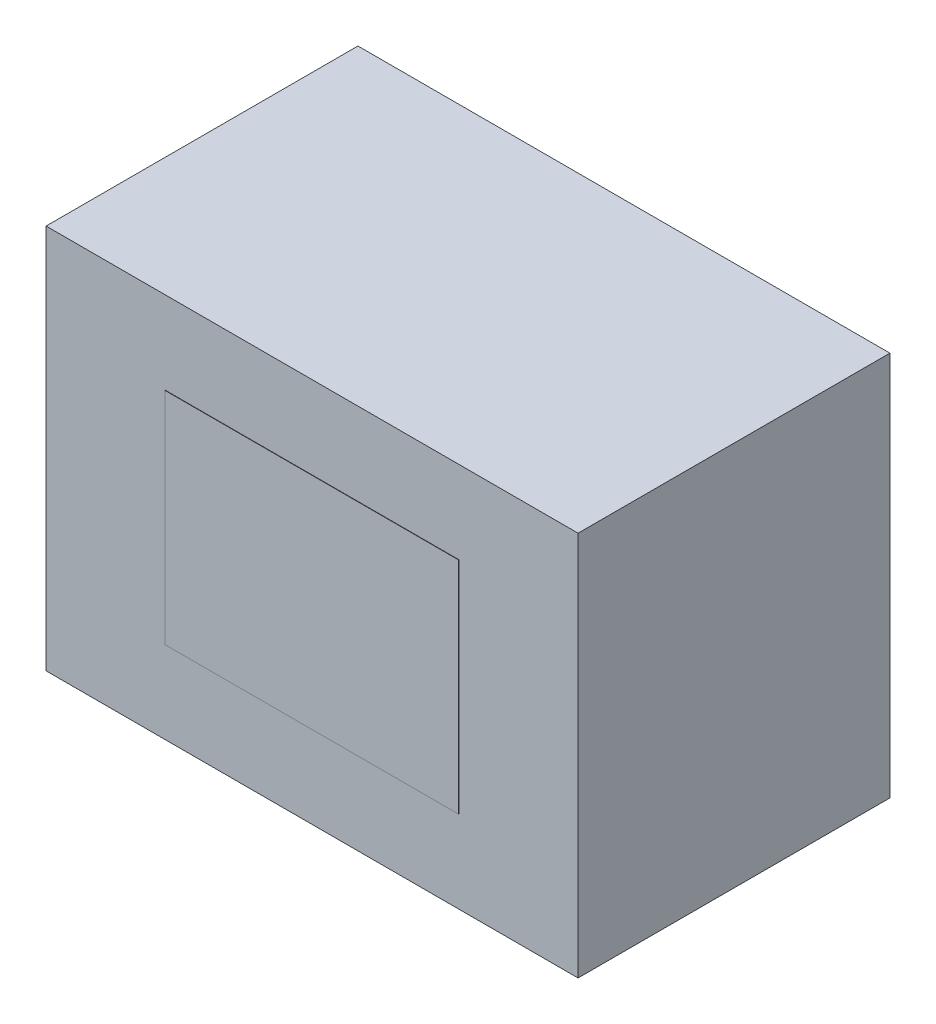
ISO-10303-21;
HEADER;
FILE_DESCRIPTION(('STEP AP214'),'2;1');
FILE_NAME('part.step','',(''),(''),'','','');
FILE_SCHEMA(('AUTOMOTIVE_DESIGN { 1 0 10303 214 1 1 1 1 }'));
ENDSEC;
DATA;
#1=APPLICATION_CONTEXT('core data for automotive mechanical design processes');
#2=APPLICATION_PROTOCOL_DEFINITION('international standard','automotive_design',2000,#1);
#3=PRODUCT_CONTEXT('',#1,'mechanical');
#4=PRODUCT('Part','Part','',(#3));
#5=PRODUCT_RELATED_PRODUCT_CATEGORY('part','',(#4));
#6=PRODUCT_DEFINITION_FORMATION('','',#4);
#7=PRODUCT_DEFINITION_CONTEXT('part definition',#1,'design');
#8=PRODUCT_DEFINITION('design','',#6,#7);
#9=PRODUCT_DEFINITION_SHAPE('','',#8);
#10=(LENGTH_UNIT() NAMED_UNIT(*) SI_UNIT(.MILLI.,.METRE.));
#11=(NAMED_UNIT(*) PLANE_ANGLE_UNIT() SI_UNIT($,.RADIAN.));
#12=(NAMED_UNIT(*) SI_UNIT($,.STERADIAN.) SOLID_ANGLE_UNIT());
#13=UNCERTAINTY_MEASURE_WITH_UNIT(LENGTH_MEASURE(1.E-05),#10,'distance_accuracy_value','');
#14=(GEOMETRIC_REPRESENTATION_CONTEXT(3) GLOBAL_UNCERTAINTY_ASSIGNED_CONTEXT((#13)) GLOBAL_UNIT_ASSIGNED_CONTEXT((#10,
#11,#12)) REPRESENTATION_CONTEXT('',''));
#15=CARTESIAN_POINT('',(0.,0.,0.));
#16=DIRECTION('',(0.,0.,1.));
#17=DIRECTION('',(1.,0.,0.));
#18=AXIS2_PLACEMENT_3D('',#15,#16,#17);
#19=CARTESIAN_POINT('',(0.,0.,104.775));
#20=DIRECTION('',(0.,0.,1.));
#21=DIRECTION('',(1.,0.,0.));
#22=AXIS2_PLACEMENT_3D('',#19,#20,#21);
#23=PLANE('',#22);
#24=DIRECTION('',(0.,-1.,0.));
#25=VECTOR('',#24,1.);
#26=CARTESIAN_POINT('',(-92.075,-63.5,104.775));
#27=LINE('',#26,#25);
#28=CARTESIAN_POINT('',(-92.075,66.675,104.775));
#29=VERTEX_POINT('',#28);
#30=CARTESIAN_POINT('',(-92.075,-66.675,104.775));
#31=VERTEX_POINT('',#30);
#32=EDGE_CURVE('E141',#29,#31,#27,.T.);
#33=ORIENTED_EDGE('',*,*,#32,.T.);
#34=DIRECTION('',(1.,0.,0.));
#35=VECTOR('',#34,1.);
#36=CARTESIAN_POINT('',(88.9,-66.675,104.775));
#37=LINE('',#36,#35);
#38=CARTESIAN_POINT('',(92.075,-66.675,104.775));
#39=VERTEX_POINT('',#38);
#40=EDGE_CURVE('E140',#31,#39,#37,.T.);
#41=ORIENTED_EDGE('',*,*,#40,.T.);
#42=DIRECTION('',(0.,1.,0.));
#43=VECTOR('',#42,1.);
#44=CARTESIAN_POINT('',(92.075,-63.5,104.775));
#45=LINE('',#44,#43);
#46=CARTESIAN_POINT('',(92.075,66.675,104.775));
#47=VERTEX_POINT('',#46);
#48=EDGE_CURVE('E38',#39,#47,#45,.T.);
#49=ORIENTED_EDGE('',*,*,#48,.T.);
#50=DIRECTION('',(-1.,0.,0.));
#51=VECTOR('',#50,1.);
#52=CARTESIAN_POINT('',(88.9,66.675,104.775));
#53=LINE('',#52,#51);
#54=EDGE_CURVE('E60',#47,#29,#53,.T.);
#55=ORIENTED_EDGE('',*,*,#54,.T.);
#56=EDGE_LOOP('',(#33,#41,#49,#55));
#57=FACE_BOUND('',#56,.T.);
#58=DIRECTION('',(-1.,0.,0.));
#59=VECTOR('',#58,1.);
#60=CARTESIAN_POINT('',(-50.8,38.1,104.775));
#61=LINE('',#60,#59);
#62=CARTESIAN_POINT('',(50.8,38.1,104.775));
#63=VERTEX_POINT('',#62);
#64=CARTESIAN_POINT('',(-50.8,38.1,104.775));
#65=VERTEX_POINT('',#64);
#66=EDGE_CURVE('E265',#63,#65,#61,.T.);
#67=ORIENTED_EDGE('',*,*,#66,.F.);
#68=DIRECTION('',(0.,1.,0.));
#69=VECTOR('',#68,1.);
#70=CARTESIAN_POINT('',(50.8,-38.1,104.775));
#71=LINE('',#70,#69);
#72=CARTESIAN_POINT('',(50.8,-38.1,104.775));
#73=VERTEX_POINT('',#72);
#74=EDGE_CURVE('E125',#73,#63,#71,.T.);
#75=ORIENTED_EDGE('',*,*,#74,.F.);
#76=DIRECTION('',(1.,0.,0.));
#77=VECTOR('',#76,1.);
#78=CARTESIAN_POINT('',(-50.8,-38.1,104.775));
#79=LINE('',#78,#77);
#80=CARTESIAN_POINT('',(-50.8,-38.1,104.775));
#81=VERTEX_POINT('',#80);
#82=EDGE_CURVE('E121',#81,#73,#79,.T.);
#83=ORIENTED_EDGE('',*,*,#82,.F.);
#84=DIRECTION('',(0.,-1.,0.));
#85=VECTOR('',#84,1.);
#86=CARTESIAN_POINT('',(-50.8,-38.1,104.775));
#87=LINE('',#86,#85);
#88=EDGE_CURVE('E262',#65,#81,#87,.T.);
#89=ORIENTED_EDGE('',*,*,#88,.F.);
#90=EDGE_LOOP('',(#67,#75,#83,#89));
#91=FACE_BOUND('',#90,.T.);
#92=ADVANCED_FACE('F35',(#57,#91),#23,.T.);
#93=CARTESIAN_POINT('',(-92.075,-63.5,101.6));
#94=DIRECTION('',(1.,0.,0.));
#95=DIRECTION('',(0.,0.,-1.));
#96=AXIS2_PLACEMENT_3D('',#93,#94,#95);
#97=PLANE('',#96);
#98=DIRECTION('',(0.,-1.,0.));
#99=VECTOR('',#98,1.);
#100=CARTESIAN_POINT('',(-92.075,-63.5,-3.175));
#101=LINE('',#100,#99);
#102=CARTESIAN_POINT('',(-92.075,66.675,-3.175));
#103=VERTEX_POINT('',#102);
#104=CARTESIAN_POINT('',(-92.075,-66.675,-3.175));
#105=VERTEX_POINT('',#104);
#106=EDGE_CURVE('E127',#103,#105,#101,.T.);
#107=ORIENTED_EDGE('',*,*,#106,.T.);
#108=DIRECTION('',(0.,0.,-1.));
#109=VECTOR('',#108,1.);
#110=CARTESIAN_POINT('',(-92.075,-66.675,101.6));
#111=LINE('',#110,#109);
#112=EDGE_CURVE('E12',#31,#105,#111,.T.);
#113=ORIENTED_EDGE('',*,*,#112,.F.);
#114=ORIENTED_EDGE('',*,*,#32,.F.);
#115=DIRECTION('',(0.,0.,-1.));
#116=VECTOR('',#115,1.);
#117=CARTESIAN_POINT('',(-92.075,66.675,101.6));
#118=LINE('',#117,#116);
#119=EDGE_CURVE('E147',#29,#103,#118,.T.);
#120=ORIENTED_EDGE('',*,*,#119,.T.);
#121=EDGE_LOOP('',(#107,#113,#114,#120));
#122=FACE_BOUND('',#121,.T.);
#123=ADVANCED_FACE('F163',(#122),#97,.F.);
#124=CARTESIAN_POINT('',(88.9,-66.675,101.6));
#125=DIRECTION('',(0.,1.,0.));
#126=DIRECTION('',(-1.,0.,0.));
#127=AXIS2_PLACEMENT_3D('',#124,#125,#126);
#128=PLANE('',#127);
#129=DIRECTION('',(1.,0.,0.));
#130=VECTOR('',#129,1.);
#131=CARTESIAN_POINT('',(88.9,-66.675,-3.175));
#132=LINE('',#131,#130);
#133=CARTESIAN_POINT('',(92.075,-66.675,-3.175));
#134=VERTEX_POINT('',#133);
#135=EDGE_CURVE('E130',#105,#134,#132,.T.);
#136=ORIENTED_EDGE('',*,*,#135,.T.);
#137=DIRECTION('',(0.,0.,-1.));
#138=VECTOR('',#137,1.);
#139=CARTESIAN_POINT('',(92.075,-66.675,101.6));
#140=LINE('',#139,#138);
#141=EDGE_CURVE('E43',#39,#134,#140,.T.);
#142=ORIENTED_EDGE('',*,*,#141,.F.);
#143=ORIENTED_EDGE('',*,*,#40,.F.);
#144=ORIENTED_EDGE('',*,*,#112,.T.);
#145=EDGE_LOOP('',(#136,#142,#143,#144));
#146=FACE_BOUND('',#145,.T.);
#147=ADVANCED_FACE('F168',(#146),#128,.F.);
#148=CARTESIAN_POINT('',(92.075,-63.5,101.6));
#149=DIRECTION('',(-1.,0.,0.));
#150=DIRECTION('',(0.,0.,1.));
#151=AXIS2_PLACEMENT_3D('',#148,#149,#150);
#152=PLANE('',#151);
#153=DIRECTION('',(0.,1.,0.));
#154=VECTOR('',#153,1.);
#155=CARTESIAN_POINT('',(92.075,-63.5,-3.175));
#156=LINE('',#155,#154);
#157=CARTESIAN_POINT('',(92.075,66.675,-3.175));
#158=VERTEX_POINT('',#157);
#159=EDGE_CURVE('E136',#134,#158,#156,.T.);
#160=ORIENTED_EDGE('',*,*,#159,.T.);
#161=DIRECTION('',(0.,0.,-1.));
#162=VECTOR('',#161,1.);
#163=CARTESIAN_POINT('',(92.075,66.675,101.6));
#164=LINE('',#163,#162);
#165=EDGE_CURVE('E139',#47,#158,#164,.T.);
#166=ORIENTED_EDGE('',*,*,#165,.F.);
#167=ORIENTED_EDGE('',*,*,#48,.F.);
#168=ORIENTED_EDGE('',*,*,#141,.T.);
#169=EDGE_LOOP('',(#160,#166,#167,#168));
#170=FACE_BOUND('',#169,.T.);
#171=ADVANCED_FACE('F169',(#170),#152,.F.);
#172=CARTESIAN_POINT('',(88.9,66.675,101.6));
#173=DIRECTION('',(0.,-1.,0.));
#174=DIRECTION('',(1.,0.,0.));
#175=AXIS2_PLACEMENT_3D('',#172,#173,#174);
#176=PLANE('',#175);
#177=DIRECTION('',(-1.,0.,0.));
#178=VECTOR('',#177,1.);
#179=CARTESIAN_POINT('',(88.9,66.675,-3.175));
#180=LINE('',#179,#178);
#181=EDGE_CURVE('E143',#158,#103,#180,.T.);
#182=ORIENTED_EDGE('',*,*,#181,.T.);
#183=ORIENTED_EDGE('',*,*,#119,.F.);
#184=ORIENTED_EDGE('',*,*,#54,.F.);
#185=ORIENTED_EDGE('',*,*,#165,.T.);
#186=EDGE_LOOP('',(#182,#183,#184,#185));
#187=FACE_BOUND('',#186,.T.);
#188=ADVANCED_FACE('F154',(#187),#176,.F.);
#189=CARTESIAN_POINT('',(0.,0.,-3.175));
#190=DIRECTION('',(0.,0.,1.));
#191=DIRECTION('',(1.,0.,0.));
#192=AXIS2_PLACEMENT_3D('',#189,#190,#191);
#193=PLANE('',#192);
#194=ORIENTED_EDGE('',*,*,#106,.F.);
#195=ORIENTED_EDGE('',*,*,#181,.F.);
#196=ORIENTED_EDGE('',*,*,#159,.F.);
#197=ORIENTED_EDGE('',*,*,#135,.F.);
#198=EDGE_LOOP('',(#194,#195,#196,#197));
#199=FACE_BOUND('',#198,.T.);
#200=ADVANCED_FACE('F160',(#199),#193,.F.);
#201=CARTESIAN_POINT('',(50.8,-38.1,104.902));
#202=DIRECTION('',(-1.,0.,0.));
#203=DIRECTION('',(0.,0.,1.));
#204=AXIS2_PLACEMENT_3D('',#201,#202,#203);
#205=PLANE('',#204);
#206=ORIENTED_EDGE('',*,*,#74,.T.);
#207=DIRECTION('',(0.,0.,-1.));
#208=VECTOR('',#207,1.);
#209=CARTESIAN_POINT('',(50.8,38.1,104.902));
#210=LINE('',#209,#208);
#211=CARTESIAN_POINT('',(50.8,38.1,104.902));
#212=VERTEX_POINT('',#211);
#213=EDGE_CURVE('E106',#212,#63,#210,.T.);
#214=ORIENTED_EDGE('',*,*,#213,.F.);
#215=DIRECTION('',(0.,1.,0.));
#216=VECTOR('',#215,1.);
#217=CARTESIAN_POINT('',(50.8,-38.1,104.902));
#218=LINE('',#217,#216);
#219=CARTESIAN_POINT('',(50.8,-38.1,104.902));
#220=VERTEX_POINT('',#219);
#221=EDGE_CURVE('E113',#220,#212,#218,.T.);
#222=ORIENTED_EDGE('',*,*,#221,.F.);
#223=DIRECTION('',(0.,0.,-1.));
#224=VECTOR('',#223,1.);
#225=CARTESIAN_POINT('',(50.8,-38.1,104.902));
#226=LINE('',#225,#224);
#227=EDGE_CURVE('E260',#220,#73,#226,.T.);
#228=ORIENTED_EDGE('',*,*,#227,.T.);
#229=EDGE_LOOP('',(#206,#214,#222,#228));
#230=FACE_BOUND('',#229,.T.);
#231=ADVANCED_FACE('F123',(#230),#205,.F.);
#232=CARTESIAN_POINT('',(-50.8,38.1,104.902));
#233=DIRECTION('',(0.,-1.,0.));
#234=DIRECTION('',(0.,0.,-1.));
#235=AXIS2_PLACEMENT_3D('',#232,#233,#234);
#236=PLANE('',#235);
#237=ORIENTED_EDGE('',*,*,#66,.T.);
#238=DIRECTION('',(0.,0.,-1.));
#239=VECTOR('',#238,1.);
#240=CARTESIAN_POINT('',(-50.8,38.1,104.902));
#241=LINE('',#240,#239);
#242=CARTESIAN_POINT('',(-50.8,38.1,104.902));
#243=VERTEX_POINT('',#242);
#244=EDGE_CURVE('E109',#243,#65,#241,.T.);
#245=ORIENTED_EDGE('',*,*,#244,.F.);
#246=DIRECTION('',(-1.,0.,0.));
#247=VECTOR('',#246,1.);
#248=CARTESIAN_POINT('',(-50.8,38.1,104.902));
#249=LINE('',#248,#247);
#250=EDGE_CURVE('E102',#212,#243,#249,.T.);
#251=ORIENTED_EDGE('',*,*,#250,.F.);
#252=ORIENTED_EDGE('',*,*,#213,.T.);
#253=EDGE_LOOP('',(#237,#245,#251,#252));
#254=FACE_BOUND('',#253,.T.);
#255=ADVANCED_FACE('F104',(#254),#236,.F.);
#256=CARTESIAN_POINT('',(-50.8,-38.1,104.902));
#257=DIRECTION('',(1.,0.,0.));
#258=DIRECTION('',(0.,0.,-1.));
#259=AXIS2_PLACEMENT_3D('',#256,#257,#258);
#260=PLANE('',#259);
#261=ORIENTED_EDGE('',*,*,#88,.T.);
#262=DIRECTION('',(0.,0.,-1.));
#263=VECTOR('',#262,1.);
#264=CARTESIAN_POINT('',(-50.8,-38.1,104.902));
#265=LINE('',#264,#263);
#266=CARTESIAN_POINT('',(-50.8,-38.1,104.902));
#267=VERTEX_POINT('',#266);
#268=EDGE_CURVE('E51',#267,#81,#265,.T.);
#269=ORIENTED_EDGE('',*,*,#268,.F.);
#270=DIRECTION('',(0.,-1.,0.));
#271=VECTOR('',#270,1.);
#272=CARTESIAN_POINT('',(-50.8,-38.1,104.902));
#273=LINE('',#272,#271);
#274=EDGE_CURVE('E112',#243,#267,#273,.T.);
#275=ORIENTED_EDGE('',*,*,#274,.F.);
#276=ORIENTED_EDGE('',*,*,#244,.T.);
#277=EDGE_LOOP('',(#261,#269,#275,#276));
#278=FACE_BOUND('',#277,.T.);
#279=ADVANCED_FACE('F191',(#278),#260,.F.);
#280=CARTESIAN_POINT('',(-50.8,-38.1,104.902));
#281=DIRECTION('',(0.,1.,0.));
#282=DIRECTION('',(0.,0.,1.));
#283=AXIS2_PLACEMENT_3D('',#280,#281,#282);
#284=PLANE('',#283);
#285=ORIENTED_EDGE('',*,*,#82,.T.);
#286=ORIENTED_EDGE('',*,*,#227,.F.);
#287=DIRECTION('',(1.,0.,0.));
#288=VECTOR('',#287,1.);
#289=CARTESIAN_POINT('',(-50.8,-38.1,104.902));
#290=LINE('',#289,#288);
#291=EDGE_CURVE('E117',#267,#220,#290,.T.);
#292=ORIENTED_EDGE('',*,*,#291,.F.);
#293=ORIENTED_EDGE('',*,*,#268,.T.);
#294=EDGE_LOOP('',(#285,#286,#292,#293));
#295=FACE_BOUND('',#294,.T.);
#296=ADVANCED_FACE('F194',(#295),#284,.F.);
#297=CARTESIAN_POINT('',(0.,0.,104.902));
#298=DIRECTION('',(0.,0.,-1.));
#299=DIRECTION('',(-1.,0.,0.));
#300=AXIS2_PLACEMENT_3D('',#297,#298,#299);
#301=PLANE('',#300);
#302=ORIENTED_EDGE('',*,*,#221,.T.);
#303=ORIENTED_EDGE('',*,*,#250,.T.);
#304=ORIENTED_EDGE('',*,*,#274,.T.);
#305=ORIENTED_EDGE('',*,*,#291,.T.);
#306=EDGE_LOOP('',(#302,#303,#304,#305));
#307=FACE_BOUND('',#306,.T.);
#308=ADVANCED_FACE('F116',(#307),#301,.F.);
#309=CLOSED_SHELL('',(#92,#123,#147,#171,#188,#200,#231,#255,#279,#296,#308));
#310=MANIFOLD_SOLID_BREP('B2',#309);
#311=ADVANCED_BREP_SHAPE_REPRESENTATION('',(#18,#310),#14);
#312=SHAPE_DEFINITION_REPRESENTATION(#9,#311);
ENDSEC;
END-ISO-10303-21;
